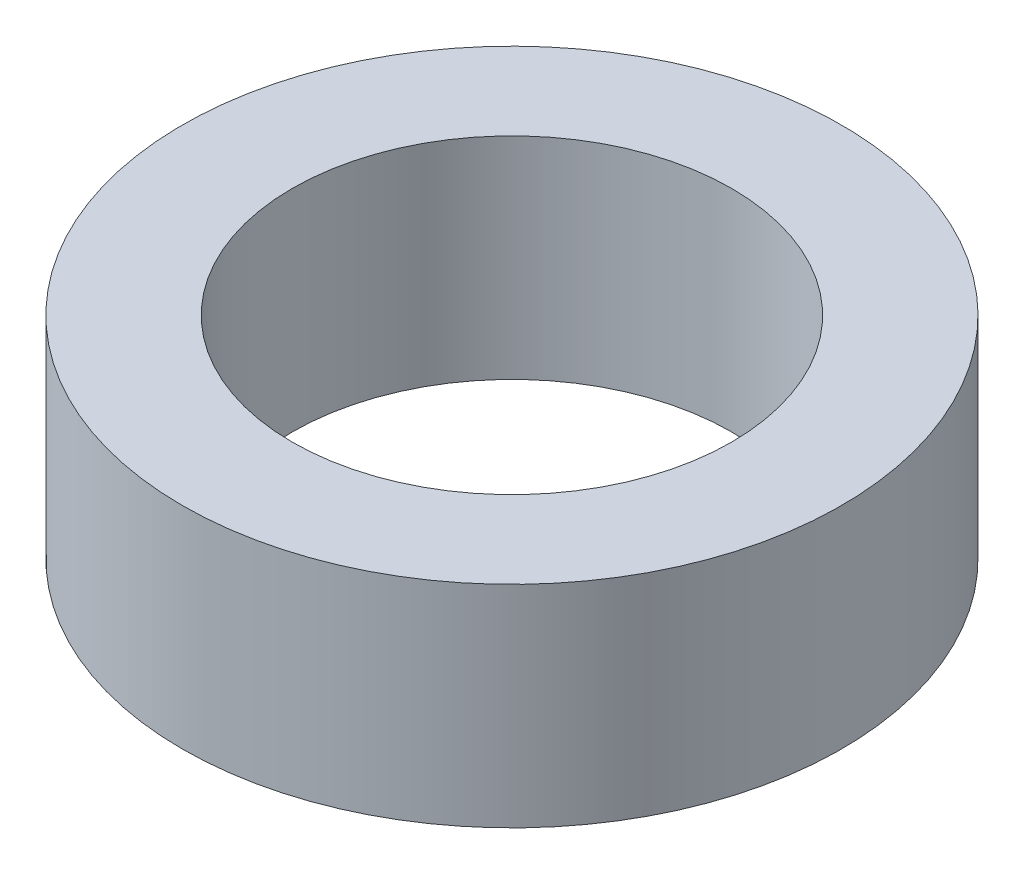
ISO-10303-21;
HEADER;
FILE_DESCRIPTION(('STEP AP214'),'2;1');
FILE_NAME('part.step','',(''),(''),'','','');
FILE_SCHEMA(('AUTOMOTIVE_DESIGN { 1 0 10303 214 1 1 1 1 }'));
ENDSEC;
DATA;
#1=APPLICATION_CONTEXT('core data for automotive mechanical design processes');
#2=APPLICATION_PROTOCOL_DEFINITION('international standard','automotive_design',2000,#1);
#3=PRODUCT_CONTEXT('',#1,'mechanical');
#4=PRODUCT('Part','Part','',(#3));
#5=PRODUCT_RELATED_PRODUCT_CATEGORY('part','',(#4));
#6=PRODUCT_DEFINITION_FORMATION('','',#4);
#7=PRODUCT_DEFINITION_CONTEXT('part definition',#1,'design');
#8=PRODUCT_DEFINITION('design','',#6,#7);
#9=PRODUCT_DEFINITION_SHAPE('','',#8);
#10=(LENGTH_UNIT() NAMED_UNIT(*) SI_UNIT(.MILLI.,.METRE.));
#11=(NAMED_UNIT(*) PLANE_ANGLE_UNIT() SI_UNIT($,.RADIAN.));
#12=(NAMED_UNIT(*) SI_UNIT($,.STERADIAN.) SOLID_ANGLE_UNIT());
#13=UNCERTAINTY_MEASURE_WITH_UNIT(LENGTH_MEASURE(1.E-05),#10,'distance_accuracy_value','');
#14=(GEOMETRIC_REPRESENTATION_CONTEXT(3) GLOBAL_UNCERTAINTY_ASSIGNED_CONTEXT((#13)) GLOBAL_UNIT_ASSIGNED_CONTEXT((#10,
#11,#12)) REPRESENTATION_CONTEXT('',''));
#15=CARTESIAN_POINT('',(0.,0.,0.));
#16=DIRECTION('',(0.,0.,1.));
#17=DIRECTION('',(1.,0.,0.));
#18=AXIS2_PLACEMENT_3D('',#15,#16,#17);
#19=CARTESIAN_POINT('',(0.,6.096,0.));
#20=DIRECTION('',(0.,1.,0.));
#21=DIRECTION('',(0.,0.,1.));
#22=AXIS2_PLACEMENT_3D('',#19,#20,#21);
#23=PLANE('',#22);
#24=CARTESIAN_POINT('',(0.,6.096,0.));
#25=DIRECTION('',(0.,1.,0.));
#26=DIRECTION('',(0.,0.,1.));
#27=AXIS2_PLACEMENT_3D('',#24,#25,#26);
#28=CIRCLE('',#27,9.52500000000001);
#29=CARTESIAN_POINT('',(0.,6.096,9.52500000000001));
#30=VERTEX_POINT('',#29);
#31=EDGE_CURVE('E10',#30,#30,#28,.T.);
#32=ORIENTED_EDGE('',*,*,#31,.T.);
#33=EDGE_LOOP('',(#32));
#34=FACE_BOUND('',#33,.T.);
#35=CARTESIAN_POINT('',(0.,6.096,0.));
#36=DIRECTION('',(0.,1.,0.));
#37=DIRECTION('',(0.,0.,1.));
#38=AXIS2_PLACEMENT_3D('',#35,#36,#37);
#39=CIRCLE('',#38,6.35);
#40=CARTESIAN_POINT('',(0.,6.096,6.35));
#41=VERTEX_POINT('',#40);
#42=EDGE_CURVE('E42',#41,#41,#39,.T.);
#43=ORIENTED_EDGE('',*,*,#42,.F.);
#44=EDGE_LOOP('',(#43));
#45=FACE_BOUND('',#44,.T.);
#46=ADVANCED_FACE('F31',(#34,#45),#23,.T.);
#47=CARTESIAN_POINT('',(0.,0.,0.));
#48=DIRECTION('',(0.,1.,0.));
#49=DIRECTION('',(0.,0.,1.));
#50=AXIS2_PLACEMENT_3D('',#47,#48,#49);
#51=PLANE('',#50);
#52=CARTESIAN_POINT('',(0.,0.,0.));
#53=DIRECTION('',(0.,1.,0.));
#54=DIRECTION('',(0.,0.,1.));
#55=AXIS2_PLACEMENT_3D('',#52,#53,#54);
#56=CIRCLE('',#55,9.52500000000001);
#57=CARTESIAN_POINT('',(0.,0.,9.52500000000001));
#58=VERTEX_POINT('',#57);
#59=EDGE_CURVE('E35',#58,#58,#56,.T.);
#60=ORIENTED_EDGE('',*,*,#59,.F.);
#61=EDGE_LOOP('',(#60));
#62=FACE_BOUND('',#61,.T.);
#63=CARTESIAN_POINT('',(0.,0.,0.));
#64=DIRECTION('',(0.,1.,0.));
#65=DIRECTION('',(0.,0.,1.));
#66=AXIS2_PLACEMENT_3D('',#63,#64,#65);
#67=CIRCLE('',#66,6.35);
#68=CARTESIAN_POINT('',(0.,0.,6.35));
#69=VERTEX_POINT('',#68);
#70=EDGE_CURVE('E44',#69,#69,#67,.T.);
#71=ORIENTED_EDGE('',*,*,#70,.T.);
#72=EDGE_LOOP('',(#71));
#73=FACE_BOUND('',#72,.T.);
#74=ADVANCED_FACE('F54',(#62,#73),#51,.F.);
#75=CARTESIAN_POINT('',(0.,6.096,0.));
#76=DIRECTION('',(0.,-1.,0.));
#77=DIRECTION('',(0.,0.,-1.));
#78=AXIS2_PLACEMENT_3D('',#75,#76,#77);
#79=CYLINDRICAL_SURFACE('',#78,9.52500000000001);
#80=ORIENTED_EDGE('',*,*,#31,.F.);
#81=EDGE_LOOP('',(#80));
#82=FACE_BOUND('',#81,.T.);
#83=ORIENTED_EDGE('',*,*,#59,.T.);
#84=EDGE_LOOP('',(#83));
#85=FACE_BOUND('',#84,.T.);
#86=ADVANCED_FACE('F33',(#82,#85),#79,.T.);
#87=CARTESIAN_POINT('',(0.,6.096,0.));
#88=DIRECTION('',(0.,-1.,0.));
#89=DIRECTION('',(0.,0.,-1.));
#90=AXIS2_PLACEMENT_3D('',#87,#88,#89);
#91=CYLINDRICAL_SURFACE('',#90,6.35);
#92=ORIENTED_EDGE('',*,*,#42,.T.);
#93=EDGE_LOOP('',(#92));
#94=FACE_BOUND('',#93,.T.);
#95=ORIENTED_EDGE('',*,*,#70,.F.);
#96=EDGE_LOOP('',(#95));
#97=FACE_BOUND('',#96,.T.);
#98=ADVANCED_FACE('F50',(#94,#97),#91,.F.);
#99=CLOSED_SHELL('',(#46,#74,#86,#98));
#100=MANIFOLD_SOLID_BREP('B2',#99);
#101=ADVANCED_BREP_SHAPE_REPRESENTATION('',(#18,#100),#14);
#102=SHAPE_DEFINITION_REPRESENTATION(#9,#101);
ENDSEC;
END-ISO-10303-21;
